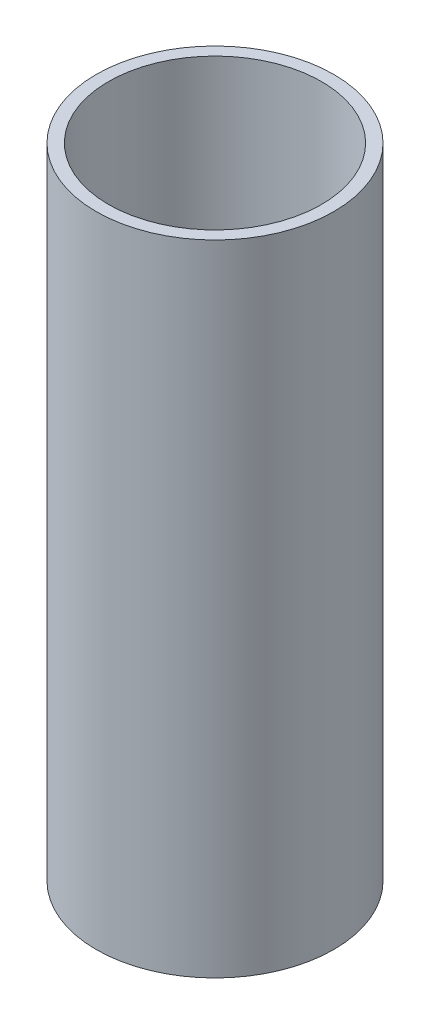
ISO-10303-21;
HEADER;
FILE_DESCRIPTION(('STEP AP214'),'2;1');
FILE_NAME('part.step','',(''),(''),'','','');
FILE_SCHEMA(('AUTOMOTIVE_DESIGN { 1 0 10303 214 1 1 1 1 }'));
ENDSEC;
DATA;
#1=APPLICATION_CONTEXT('core data for automotive mechanical design processes');
#2=APPLICATION_PROTOCOL_DEFINITION('international standard','automotive_design',2000,#1);
#3=PRODUCT_CONTEXT('',#1,'mechanical');
#4=PRODUCT('Part','Part','',(#3));
#5=PRODUCT_RELATED_PRODUCT_CATEGORY('part','',(#4));
#6=PRODUCT_DEFINITION_FORMATION('','',#4);
#7=PRODUCT_DEFINITION_CONTEXT('part definition',#1,'design');
#8=PRODUCT_DEFINITION('design','',#6,#7);
#9=PRODUCT_DEFINITION_SHAPE('','',#8);
#10=(LENGTH_UNIT() NAMED_UNIT(*) SI_UNIT(.MILLI.,.METRE.));
#11=(NAMED_UNIT(*) PLANE_ANGLE_UNIT() SI_UNIT($,.RADIAN.));
#12=(NAMED_UNIT(*) SI_UNIT($,.STERADIAN.) SOLID_ANGLE_UNIT());
#13=UNCERTAINTY_MEASURE_WITH_UNIT(LENGTH_MEASURE(1.E-05),#10,'distance_accuracy_value','');
#14=(GEOMETRIC_REPRESENTATION_CONTEXT(3) GLOBAL_UNCERTAINTY_ASSIGNED_CONTEXT((#13)) GLOBAL_UNIT_ASSIGNED_CONTEXT((#10,
#11,#12)) REPRESENTATION_CONTEXT('',''));
#15=CARTESIAN_POINT('',(0.,0.,0.));
#16=DIRECTION('',(0.,0.,1.));
#17=DIRECTION('',(1.,0.,0.));
#18=AXIS2_PLACEMENT_3D('',#15,#16,#17);
#19=CARTESIAN_POINT('',(0.,304.8,0.));
#20=DIRECTION('',(0.,1.,0.));
#21=DIRECTION('',(0.,0.,1.));
#22=AXIS2_PLACEMENT_3D('',#19,#20,#21);
#23=PLANE('',#22);
#24=CARTESIAN_POINT('',(0.,304.8,0.));
#25=DIRECTION('',(0.,1.,0.));
#26=DIRECTION('',(1.,0.,0.));
#27=AXIS2_PLACEMENT_3D('',#24,#25,#26);
#28=CIRCLE('',#27,56.6674);
#29=CARTESIAN_POINT('',(56.6674,304.8,0.));
#30=VERTEX_POINT('',#29);
#31=EDGE_CURVE('E11',#30,#30,#28,.T.);
#32=ORIENTED_EDGE('',*,*,#31,.T.);
#33=EDGE_LOOP('',(#32));
#34=FACE_BOUND('',#33,.T.);
#35=CARTESIAN_POINT('',(0.,304.8,0.));
#36=DIRECTION('',(0.,1.,0.));
#37=DIRECTION('',(0.,0.,1.));
#38=AXIS2_PLACEMENT_3D('',#35,#36,#37);
#39=CIRCLE('',#38,50.8);
#40=CARTESIAN_POINT('',(0.,304.8,50.8));
#41=VERTEX_POINT('',#40);
#42=EDGE_CURVE('E56',#41,#41,#39,.T.);
#43=ORIENTED_EDGE('',*,*,#42,.F.);
#44=EDGE_LOOP('',(#43));
#45=FACE_BOUND('',#44,.T.);
#46=ADVANCED_FACE('F45',(#34,#45),#23,.T.);
#47=CARTESIAN_POINT('',(0.,0.,0.));
#48=DIRECTION('',(0.,1.,0.));
#49=DIRECTION('',(0.,0.,1.));
#50=AXIS2_PLACEMENT_3D('',#47,#48,#49);
#51=PLANE('',#50);
#52=CARTESIAN_POINT('',(0.,0.,0.));
#53=DIRECTION('',(0.,1.,0.));
#54=DIRECTION('',(1.,0.,0.));
#55=AXIS2_PLACEMENT_3D('',#52,#53,#54);
#56=CIRCLE('',#55,56.6674);
#57=CARTESIAN_POINT('',(56.6674,0.,0.));
#58=VERTEX_POINT('',#57);
#59=EDGE_CURVE('E49',#58,#58,#56,.T.);
#60=ORIENTED_EDGE('',*,*,#59,.F.);
#61=EDGE_LOOP('',(#60));
#62=FACE_BOUND('',#61,.T.);
#63=CARTESIAN_POINT('',(0.,0.,0.));
#64=DIRECTION('',(0.,1.,0.));
#65=DIRECTION('',(0.,0.,1.));
#66=AXIS2_PLACEMENT_3D('',#63,#64,#65);
#67=CIRCLE('',#66,50.8);
#68=CARTESIAN_POINT('',(0.,0.,50.8));
#69=VERTEX_POINT('',#68);
#70=EDGE_CURVE('E58',#69,#69,#67,.T.);
#71=ORIENTED_EDGE('',*,*,#70,.T.);
#72=EDGE_LOOP('',(#71));
#73=FACE_BOUND('',#72,.T.);
#74=ADVANCED_FACE('F68',(#62,#73),#51,.F.);
#75=CARTESIAN_POINT('',(0.,304.8,0.));
#76=DIRECTION('',(0.,-1.,0.));
#77=DIRECTION('',(0.,0.,-1.));
#78=AXIS2_PLACEMENT_3D('',#75,#76,#77);
#79=CYLINDRICAL_SURFACE('',#78,56.6674);
#80=ORIENTED_EDGE('',*,*,#31,.F.);
#81=EDGE_LOOP('',(#80));
#82=FACE_BOUND('',#81,.T.);
#83=ORIENTED_EDGE('',*,*,#59,.T.);
#84=EDGE_LOOP('',(#83));
#85=FACE_BOUND('',#84,.T.);
#86=ADVANCED_FACE('F47',(#82,#85),#79,.T.);
#87=CARTESIAN_POINT('',(0.,304.8,0.));
#88=DIRECTION('',(0.,-1.,0.));
#89=DIRECTION('',(0.,0.,-1.));
#90=AXIS2_PLACEMENT_3D('',#87,#88,#89);
#91=CYLINDRICAL_SURFACE('',#90,50.8);
#92=ORIENTED_EDGE('',*,*,#42,.T.);
#93=EDGE_LOOP('',(#92));
#94=FACE_BOUND('',#93,.T.);
#95=ORIENTED_EDGE('',*,*,#70,.F.);
#96=EDGE_LOOP('',(#95));
#97=FACE_BOUND('',#96,.T.);
#98=ADVANCED_FACE('F64',(#94,#97),#91,.F.);
#99=CLOSED_SHELL('',(#46,#74,#86,#98));
#100=MANIFOLD_SOLID_BREP('B2',#99);
#101=ADVANCED_BREP_SHAPE_REPRESENTATION('',(#18,#100),#14);
#102=SHAPE_DEFINITION_REPRESENTATION(#9,#101);
ENDSEC;
END-ISO-10303-21;
